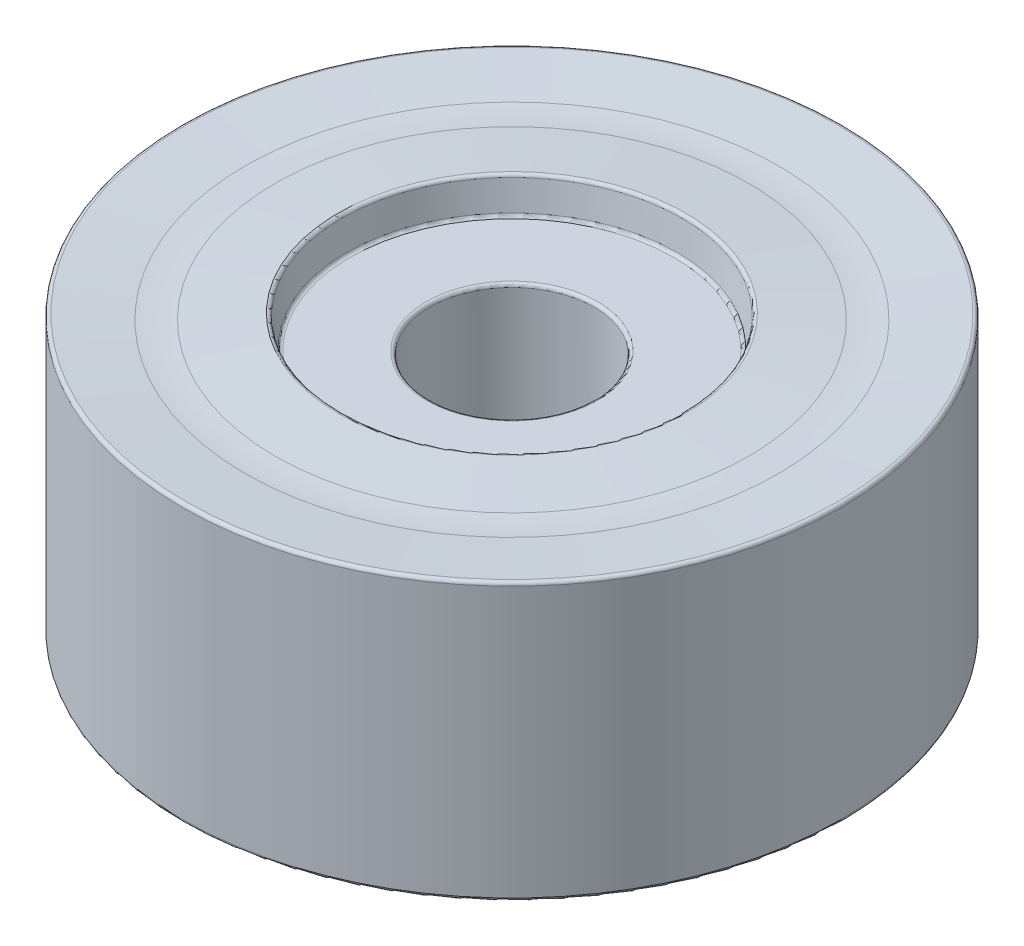
ISO-10303-21;
HEADER;
FILE_DESCRIPTION(('STEP AP214'),'2;1');
FILE_NAME('part.step','',(''),(''),'','','');
FILE_SCHEMA(('AUTOMOTIVE_DESIGN { 1 0 10303 214 1 1 1 1 }'));
ENDSEC;
DATA;
#1=APPLICATION_CONTEXT('core data for automotive mechanical design processes');
#2=APPLICATION_PROTOCOL_DEFINITION('international standard','automotive_design',2000,#1);
#3=PRODUCT_CONTEXT('',#1,'mechanical');
#4=PRODUCT('Part','Part','',(#3));
#5=PRODUCT_RELATED_PRODUCT_CATEGORY('part','',(#4));
#6=PRODUCT_DEFINITION_FORMATION('','',#4);
#7=PRODUCT_DEFINITION_CONTEXT('part definition',#1,'design');
#8=PRODUCT_DEFINITION('design','',#6,#7);
#9=PRODUCT_DEFINITION_SHAPE('','',#8);
#10=(LENGTH_UNIT() NAMED_UNIT(*) SI_UNIT(.MILLI.,.METRE.));
#11=(NAMED_UNIT(*) PLANE_ANGLE_UNIT() SI_UNIT($,.RADIAN.));
#12=(NAMED_UNIT(*) SI_UNIT($,.STERADIAN.) SOLID_ANGLE_UNIT());
#13=UNCERTAINTY_MEASURE_WITH_UNIT(LENGTH_MEASURE(1.E-05),#10,'distance_accuracy_value','');
#14=(GEOMETRIC_REPRESENTATION_CONTEXT(3) GLOBAL_UNCERTAINTY_ASSIGNED_CONTEXT((#13)) GLOBAL_UNIT_ASSIGNED_CONTEXT((#10,
#11,#12)) REPRESENTATION_CONTEXT('',''));
#15=CARTESIAN_POINT('',(0.,0.,0.));
#16=DIRECTION('',(0.,0.,1.));
#17=DIRECTION('',(1.,0.,0.));
#18=AXIS2_PLACEMENT_3D('',#15,#16,#17);
#19=CARTESIAN_POINT('',(0.,13.2,0.));
#20=DIRECTION('',(0.,1.,0.));
#21=DIRECTION('',(0.,0.,1.));
#22=AXIS2_PLACEMENT_3D('',#19,#20,#21);
#23=TOROIDAL_SURFACE('',#22,7.62425720164646,5.);
#24=CARTESIAN_POINT('',(0.,8.22010456764698,0.));
#25=DIRECTION('',(0.,1.,0.));
#26=DIRECTION('',(0.,0.,1.));
#27=AXIS2_PLACEMENT_3D('',#24,#25,#26);
#28=CIRCLE('',#27,7.17632698070846);
#29=CARTESIAN_POINT('',(0.,8.22010456764698,7.17632698070846));
#30=VERTEX_POINT('',#29);
#31=EDGE_CURVE('E87',#30,#30,#28,.T.);
#32=ORIENTED_EDGE('',*,*,#31,.F.);
#33=EDGE_LOOP('',(#32));
#34=FACE_BOUND('',#33,.T.);
#35=CARTESIAN_POINT('',(0.,8.22163521053035,0.));
#36=DIRECTION('',(0.,1.,0.));
#37=DIRECTION('',(0.,0.,1.));
#38=AXIS2_PLACEMENT_3D('',#35,#36,#37);
#39=CIRCLE('',#38,8.08889041501905);
#40=CARTESIAN_POINT('',(0.,8.22163521053035,8.08889041501905));
#41=VERTEX_POINT('',#40);
#42=EDGE_CURVE('E90',#41,#41,#39,.T.);
#43=ORIENTED_EDGE('',*,*,#42,.T.);
#44=EDGE_LOOP('',(#43));
#45=FACE_BOUND('',#44,.T.);
#46=ADVANCED_FACE('F31',(#34,#45),#23,.F.);
#47=CARTESIAN_POINT('',(0.,8.22010456764698,0.));
#48=DIRECTION('',(0.,-1.,0.));
#49=DIRECTION('',(0.,0.,-1.));
#50=AXIS2_PLACEMENT_3D('',#47,#48,#49);
#51=CONICAL_SURFACE('',#50,7.17632698070846,1.48109001657428);
#52=CARTESIAN_POINT('',(0.,8.39177082365109,0.));
#53=DIRECTION('',(0.,1.,0.));
#54=DIRECTION('',(0.,0.,1.));
#55=AXIS2_PLACEMENT_3D('',#52,#53,#54);
#56=CIRCLE('',#55,5.26781542197986);
#57=CARTESIAN_POINT('',(0.,8.39177082365109,5.26781542197986));
#58=VERTEX_POINT('',#57);
#59=EDGE_CURVE('E78',#58,#58,#56,.F.);
#60=ORIENTED_EDGE('',*,*,#59,.T.);
#61=EDGE_LOOP('',(#60));
#62=FACE_BOUND('',#61,.T.);
#63=ORIENTED_EDGE('',*,*,#31,.T.);
#64=EDGE_LOOP('',(#63));
#65=FACE_BOUND('',#64,.T.);
#66=ADVANCED_FACE('F110',(#62,#65),#51,.T.);
#67=CARTESIAN_POINT('',(0.,8.4,0.));
#68=DIRECTION('',(0.,1.,0.));
#69=DIRECTION('',(0.,0.,1.));
#70=AXIS2_PLACEMENT_3D('',#67,#68,#69);
#71=CONICAL_SURFACE('',#70,5.17632698070846,0.17453292519943);
#72=CARTESIAN_POINT('',(0.,8.30953773277073,0.));
#73=DIRECTION('',(0.,-1.,0.));
#74=DIRECTION('',(0.,0.,-1.));
#75=AXIS2_PLACEMENT_3D('',#72,#73,#74);
#76=CIRCLE('',#75,5.16037604225988);
#77=CARTESIAN_POINT('',(0.,8.30953773277073,-5.16037604225988));
#78=VERTEX_POINT('',#77);
#79=EDGE_CURVE('E81',#78,#78,#76,.F.);
#80=ORIENTED_EDGE('',*,*,#79,.T.);
#81=EDGE_LOOP('',(#80));
#82=FACE_BOUND('',#81,.T.);
#83=CARTESIAN_POINT('',(0.,7.48263518223331,0.));
#84=DIRECTION('',(0.,1.,0.));
#85=DIRECTION('',(0.,0.,1.));
#86=AXIS2_PLACEMENT_3D('',#83,#84,#85);
#87=CIRCLE('',#86,5.01457081218349);
#88=CARTESIAN_POINT('',(0.,7.48263518223331,5.01457081218349));
#89=VERTEX_POINT('',#88);
#90=EDGE_CURVE('E84',#89,#89,#87,.F.);
#91=ORIENTED_EDGE('',*,*,#90,.T.);
#92=EDGE_LOOP('',(#91));
#93=FACE_BOUND('',#92,.T.);
#94=ADVANCED_FACE('F116',(#82,#93),#71,.F.);
#95=CARTESIAN_POINT('',(0.,7.4,-2.5));
#96=DIRECTION('',(0.,-1.,0.));
#97=DIRECTION('',(0.,0.,-1.));
#98=AXIS2_PLACEMENT_3D('',#95,#96,#97);
#99=PLANE('',#98);
#100=CARTESIAN_POINT('',(0.,7.4,0.));
#101=DIRECTION('',(0.,-1.,0.));
#102=DIRECTION('',(0.,0.,-1.));
#103=AXIS2_PLACEMENT_3D('',#100,#101,#102);
#104=CIRCLE('',#103,4.91609003688227);
#105=CARTESIAN_POINT('',(0.,7.4,-4.91609003688227));
#106=VERTEX_POINT('',#105);
#107=EDGE_CURVE('E72',#106,#106,#104,.F.);
#108=ORIENTED_EDGE('',*,*,#107,.T.);
#109=EDGE_LOOP('',(#108));
#110=FACE_BOUND('',#109,.T.);
#111=CARTESIAN_POINT('',(0.,7.4,0.));
#112=DIRECTION('',(0.,-1.,0.));
#113=DIRECTION('',(0.,0.,-1.));
#114=AXIS2_PLACEMENT_3D('',#111,#112,#113);
#115=CIRCLE('',#114,2.6);
#116=CARTESIAN_POINT('',(0.,7.4,-2.6));
#117=VERTEX_POINT('',#116);
#118=EDGE_CURVE('E75',#117,#117,#115,.T.);
#119=ORIENTED_EDGE('',*,*,#118,.T.);
#120=EDGE_LOOP('',(#119));
#121=FACE_BOUND('',#120,.T.);
#122=ADVANCED_FACE('F167',(#110,#121),#99,.F.);
#123=CARTESIAN_POINT('',(0.,8.4,0.));
#124=DIRECTION('',(0.,1.,0.));
#125=DIRECTION('',(0.,0.,1.));
#126=AXIS2_PLACEMENT_3D('',#123,#124,#125);
#127=CYLINDRICAL_SURFACE('',#126,2.5);
#128=CARTESIAN_POINT('',(0.,7.3,0.));
#129=DIRECTION('',(0.,-1.,0.));
#130=DIRECTION('',(0.,0.,-1.));
#131=AXIS2_PLACEMENT_3D('',#128,#129,#130);
#132=CIRCLE('',#131,2.5);
#133=CARTESIAN_POINT('',(0.,7.3,-2.5));
#134=VERTEX_POINT('',#133);
#135=EDGE_CURVE('E66',#134,#134,#132,.F.);
#136=ORIENTED_EDGE('',*,*,#135,.T.);
#137=EDGE_LOOP('',(#136));
#138=FACE_BOUND('',#137,.T.);
#139=CARTESIAN_POINT('',(0.,3.6,0.));
#140=DIRECTION('',(0.,1.,0.));
#141=DIRECTION('',(0.,0.,1.));
#142=AXIS2_PLACEMENT_3D('',#139,#140,#141);
#143=CIRCLE('',#142,2.5);
#144=CARTESIAN_POINT('',(0.,3.6,2.5));
#145=VERTEX_POINT('',#144);
#146=EDGE_CURVE('E69',#145,#145,#143,.F.);
#147=ORIENTED_EDGE('',*,*,#146,.T.);
#148=EDGE_LOOP('',(#147));
#149=FACE_BOUND('',#148,.T.);
#150=ADVANCED_FACE('F163',(#138,#149),#127,.F.);
#151=CARTESIAN_POINT('',(0.,3.5,-2.5));
#152=DIRECTION('',(0.,1.,0.));
#153=DIRECTION('',(0.,0.,1.));
#154=AXIS2_PLACEMENT_3D('',#151,#152,#153);
#155=PLANE('',#154);
#156=CARTESIAN_POINT('',(0.,3.5,0.));
#157=DIRECTION('',(0.,1.,0.));
#158=DIRECTION('',(0.,0.,1.));
#159=AXIS2_PLACEMENT_3D('',#156,#157,#158);
#160=CIRCLE('',#159,2.6);
#161=CARTESIAN_POINT('',(0.,3.5,2.6));
#162=VERTEX_POINT('',#161);
#163=EDGE_CURVE('E60',#162,#162,#160,.T.);
#164=ORIENTED_EDGE('',*,*,#163,.T.);
#165=EDGE_LOOP('',(#164));
#166=FACE_BOUND('',#165,.T.);
#167=CARTESIAN_POINT('',(0.,3.5,0.));
#168=DIRECTION('',(0.,1.,0.));
#169=DIRECTION('',(0.,0.,1.));
#170=AXIS2_PLACEMENT_3D('',#167,#168,#169);
#171=CIRCLE('',#170,6.4);
#172=CARTESIAN_POINT('',(0.,3.5,6.4));
#173=VERTEX_POINT('',#172);
#174=EDGE_CURVE('E63',#173,#173,#171,.F.);
#175=ORIENTED_EDGE('',*,*,#174,.T.);
#176=EDGE_LOOP('',(#175));
#177=FACE_BOUND('',#176,.T.);
#178=ADVANCED_FACE('F157',(#166,#177),#155,.F.);
#179=CARTESIAN_POINT('',(0.,8.4,0.));
#180=DIRECTION('',(0.,1.,0.));
#181=DIRECTION('',(0.,0.,1.));
#182=AXIS2_PLACEMENT_3D('',#179,#180,#181);
#183=CYLINDRICAL_SURFACE('',#182,6.5);
#184=CARTESIAN_POINT('',(0.,3.4,0.));
#185=DIRECTION('',(0.,1.,0.));
#186=DIRECTION('',(0.,0.,1.));
#187=AXIS2_PLACEMENT_3D('',#184,#185,#186);
#188=CIRCLE('',#187,6.5);
#189=CARTESIAN_POINT('',(0.,3.4,6.5));
#190=VERTEX_POINT('',#189);
#191=EDGE_CURVE('E54',#190,#190,#188,.T.);
#192=ORIENTED_EDGE('',*,*,#191,.T.);
#193=EDGE_LOOP('',(#192));
#194=FACE_BOUND('',#193,.T.);
#195=CARTESIAN_POINT('',(0.,0.0999999999999994,0.));
#196=DIRECTION('',(0.,1.,0.));
#197=DIRECTION('',(0.,0.,1.));
#198=AXIS2_PLACEMENT_3D('',#195,#196,#197);
#199=CIRCLE('',#198,6.5);
#200=CARTESIAN_POINT('',(0.,0.0999999999999994,6.5));
#201=VERTEX_POINT('',#200);
#202=EDGE_CURVE('E57',#201,#201,#199,.F.);
#203=ORIENTED_EDGE('',*,*,#202,.T.);
#204=EDGE_LOOP('',(#203));
#205=FACE_BOUND('',#204,.T.);
#206=ADVANCED_FACE('F151',(#194,#205),#183,.F.);
#207=CARTESIAN_POINT('',(0.,0.,-6.5));
#208=DIRECTION('',(0.,1.,0.));
#209=DIRECTION('',(0.,0.,1.));
#210=AXIS2_PLACEMENT_3D('',#207,#208,#209);
#211=PLANE('',#210);
#212=CARTESIAN_POINT('',(0.,0.,0.));
#213=DIRECTION('',(0.,1.,0.));
#214=DIRECTION('',(0.,0.,1.));
#215=AXIS2_PLACEMENT_3D('',#212,#213,#214);
#216=CIRCLE('',#215,6.6);
#217=CARTESIAN_POINT('',(0.,0.,6.6));
#218=VERTEX_POINT('',#217);
#219=EDGE_CURVE('E46',#218,#218,#216,.T.);
#220=ORIENTED_EDGE('',*,*,#219,.T.);
#221=EDGE_LOOP('',(#220));
#222=FACE_BOUND('',#221,.T.);
#223=CARTESIAN_POINT('',(0.,0.,0.));
#224=DIRECTION('',(0.,1.,0.));
#225=DIRECTION('',(0.,0.,1.));
#226=AXIS2_PLACEMENT_3D('',#223,#224,#225);
#227=CIRCLE('',#226,9.9);
#228=CARTESIAN_POINT('',(0.,0.,9.9));
#229=VERTEX_POINT('',#228);
#230=EDGE_CURVE('E51',#229,#229,#227,.F.);
#231=ORIENTED_EDGE('',*,*,#230,.T.);
#232=EDGE_LOOP('',(#231));
#233=FACE_BOUND('',#232,.T.);
#234=ADVANCED_FACE('F107',(#222,#233),#211,.F.);
#235=CARTESIAN_POINT('',(0.,8.4,0.));
#236=DIRECTION('',(0.,1.,0.));
#237=DIRECTION('',(0.,0.,1.));
#238=AXIS2_PLACEMENT_3D('',#235,#236,#237);
#239=CYLINDRICAL_SURFACE('',#238,10.);
#240=CARTESIAN_POINT('',(0.,0.0999999999999994,0.));
#241=DIRECTION('',(0.,1.,0.));
#242=DIRECTION('',(0.,0.,1.));
#243=AXIS2_PLACEMENT_3D('',#240,#241,#242);
#244=CIRCLE('',#243,10.);
#245=CARTESIAN_POINT('',(0.,0.0999999999999994,10.));
#246=VERTEX_POINT('',#245);
#247=EDGE_CURVE('E38',#246,#246,#244,.T.);
#248=ORIENTED_EDGE('',*,*,#247,.T.);
#249=EDGE_LOOP('',(#248));
#250=FACE_BOUND('',#249,.T.);
#251=CARTESIAN_POINT('',(0.,8.29023236656077,0.));
#252=DIRECTION('',(0.,-1.,0.));
#253=DIRECTION('',(0.,0.,-1.));
#254=AXIS2_PLACEMENT_3D('',#251,#252,#253);
#255=CIRCLE('',#254,10.);
#256=CARTESIAN_POINT('',(0.,8.29023236656077,-10.));
#257=VERTEX_POINT('',#256);
#258=EDGE_CURVE('E42',#257,#257,#255,.T.);
#259=ORIENTED_EDGE('',*,*,#258,.T.);
#260=EDGE_LOOP('',(#259));
#261=FACE_BOUND('',#260,.T.);
#262=ADVANCED_FACE('F98',(#250,#261),#239,.T.);
#263=CARTESIAN_POINT('',(0.,8.4,0.));
#264=DIRECTION('',(0.,1.,0.));
#265=DIRECTION('',(0.,0.,1.));
#266=AXIS2_PLACEMENT_3D('',#263,#264,#265);
#267=CONICAL_SURFACE('',#266,10.,1.4777354192051);
#268=CARTESIAN_POINT('',(0.,8.38979966235017,0.));
#269=DIRECTION('',(0.,-1.,0.));
#270=DIRECTION('',(0.,0.,-1.));
#271=AXIS2_PLACEMENT_3D('',#268,#269,#270);
#272=CIRCLE('',#271,9.89070733573255);
#273=CARTESIAN_POINT('',(0.,8.38979966235017,-9.89070733573255));
#274=VERTEX_POINT('',#273);
#275=EDGE_CURVE('E10',#274,#274,#272,.F.);
#276=ORIENTED_EDGE('',*,*,#275,.T.);
#277=EDGE_LOOP('',(#276));
#278=FACE_BOUND('',#277,.T.);
#279=ORIENTED_EDGE('',*,*,#42,.F.);
#280=EDGE_LOOP('',(#279));
#281=FACE_BOUND('',#280,.T.);
#282=ADVANCED_FACE('F95',(#278,#281),#267,.F.);
#283=CARTESIAN_POINT('',(0.,8.29217291500403,0.));
#284=DIRECTION('',(0.,-1.,0.));
#285=DIRECTION('',(0.,0.,-1.));
#286=AXIS2_PLACEMENT_3D('',#283,#284,#285);
#287=TOROIDAL_SURFACE('',#286,5.2588568175611,0.1);
#288=ORIENTED_EDGE('',*,*,#59,.F.);
#289=EDGE_LOOP('',(#288));
#290=FACE_BOUND('',#289,.T.);
#291=ORIENTED_EDGE('',*,*,#79,.F.);
#292=EDGE_LOOP('',(#291));
#293=FACE_BOUND('',#292,.T.);
#294=ADVANCED_FACE('F97',(#290,#293),#287,.T.);
#295=CARTESIAN_POINT('',(0.,7.5,0.));
#296=DIRECTION('',(0.,-1.,0.));
#297=DIRECTION('',(0.,0.,-1.));
#298=AXIS2_PLACEMENT_3D('',#295,#296,#297);
#299=TOROIDAL_SURFACE('',#298,4.91609003688227,0.1);
#300=ORIENTED_EDGE('',*,*,#90,.F.);
#301=EDGE_LOOP('',(#300));
#302=FACE_BOUND('',#301,.T.);
#303=ORIENTED_EDGE('',*,*,#107,.F.);
#304=EDGE_LOOP('',(#303));
#305=FACE_BOUND('',#304,.T.);
#306=ADVANCED_FACE('F104',(#302,#305),#299,.F.);
#307=CARTESIAN_POINT('',(0.,7.3,0.));
#308=DIRECTION('',(0.,-1.,0.));
#309=DIRECTION('',(0.,0.,-1.));
#310=AXIS2_PLACEMENT_3D('',#307,#308,#309);
#311=TOROIDAL_SURFACE('',#310,2.6,0.1);
#312=ORIENTED_EDGE('',*,*,#118,.F.);
#313=EDGE_LOOP('',(#312));
#314=FACE_BOUND('',#313,.T.);
#315=ORIENTED_EDGE('',*,*,#135,.F.);
#316=EDGE_LOOP('',(#315));
#317=FACE_BOUND('',#316,.T.);
#318=ADVANCED_FACE('F124',(#314,#317),#311,.T.);
#319=CARTESIAN_POINT('',(0.,3.6,0.));
#320=DIRECTION('',(0.,1.,0.));
#321=DIRECTION('',(0.,0.,1.));
#322=AXIS2_PLACEMENT_3D('',#319,#320,#321);
#323=TOROIDAL_SURFACE('',#322,2.6,0.1);
#324=ORIENTED_EDGE('',*,*,#146,.F.);
#325=EDGE_LOOP('',(#324));
#326=FACE_BOUND('',#325,.T.);
#327=ORIENTED_EDGE('',*,*,#163,.F.);
#328=EDGE_LOOP('',(#327));
#329=FACE_BOUND('',#328,.T.);
#330=ADVANCED_FACE('F128',(#326,#329),#323,.T.);
#331=CARTESIAN_POINT('',(0.,3.4,0.));
#332=DIRECTION('',(0.,1.,0.));
#333=DIRECTION('',(0.,0.,1.));
#334=AXIS2_PLACEMENT_3D('',#331,#332,#333);
#335=TOROIDAL_SURFACE('',#334,6.4,0.1);
#336=ORIENTED_EDGE('',*,*,#174,.F.);
#337=EDGE_LOOP('',(#336));
#338=FACE_BOUND('',#337,.T.);
#339=ORIENTED_EDGE('',*,*,#191,.F.);
#340=EDGE_LOOP('',(#339));
#341=FACE_BOUND('',#340,.T.);
#342=ADVANCED_FACE('F132',(#338,#341),#335,.F.);
#343=CARTESIAN_POINT('',(0.,0.0999999999999994,0.));
#344=DIRECTION('',(0.,1.,0.));
#345=DIRECTION('',(0.,0.,1.));
#346=AXIS2_PLACEMENT_3D('',#343,#344,#345);
#347=TOROIDAL_SURFACE('',#346,6.6,0.1);
#348=ORIENTED_EDGE('',*,*,#202,.F.);
#349=EDGE_LOOP('',(#348));
#350=FACE_BOUND('',#349,.T.);
#351=ORIENTED_EDGE('',*,*,#219,.F.);
#352=EDGE_LOOP('',(#351));
#353=FACE_BOUND('',#352,.T.);
#354=ADVANCED_FACE('F136',(#350,#353),#347,.T.);
#355=CARTESIAN_POINT('',(0.,0.0999999999999994,0.));
#356=DIRECTION('',(0.,1.,0.));
#357=DIRECTION('',(0.,0.,1.));
#358=AXIS2_PLACEMENT_3D('',#355,#356,#357);
#359=TOROIDAL_SURFACE('',#358,9.9,0.1);
#360=ORIENTED_EDGE('',*,*,#230,.F.);
#361=EDGE_LOOP('',(#360));
#362=FACE_BOUND('',#361,.T.);
#363=ORIENTED_EDGE('',*,*,#247,.F.);
#364=EDGE_LOOP('',(#363));
#365=FACE_BOUND('',#364,.T.);
#366=ADVANCED_FACE('F139',(#362,#365),#359,.T.);
#367=CARTESIAN_POINT('',(0.,8.29023236656077,0.));
#368=DIRECTION('',(0.,-1.,0.));
#369=DIRECTION('',(0.,0.,-1.));
#370=AXIS2_PLACEMENT_3D('',#367,#368,#369);
#371=TOROIDAL_SURFACE('',#370,9.9,0.1);
#372=ORIENTED_EDGE('',*,*,#258,.F.);
#373=EDGE_LOOP('',(#372));
#374=FACE_BOUND('',#373,.T.);
#375=ORIENTED_EDGE('',*,*,#275,.F.);
#376=EDGE_LOOP('',(#375));
#377=FACE_BOUND('',#376,.T.);
#378=ADVANCED_FACE('F33',(#374,#377),#371,.T.);
#379=CLOSED_SHELL('',(#46,#66,#94,#122,#150,#178,#206,#234,#262,#282,#294,#306,#318,#330,#342,
#354,#366,#378));
#380=MANIFOLD_SOLID_BREP('B2',#379);
#381=ADVANCED_BREP_SHAPE_REPRESENTATION('',(#18,#380),#14);
#382=SHAPE_DEFINITION_REPRESENTATION(#9,#381);
ENDSEC;
END-ISO-10303-21;
